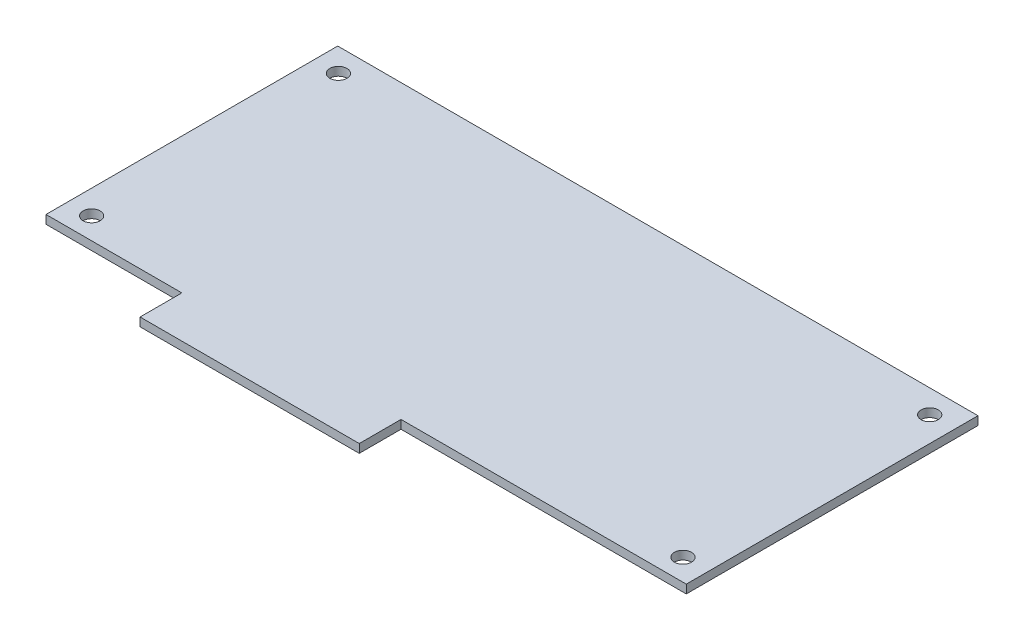
ISO-10303-21;
HEADER;
FILE_DESCRIPTION(('STEP AP214'),'2;1');
FILE_NAME('part.step','',(''),(''),'','','');
FILE_SCHEMA(('AUTOMOTIVE_DESIGN { 1 0 10303 214 1 1 1 1 }'));
ENDSEC;
DATA;
#1=APPLICATION_CONTEXT('core data for automotive mechanical design processes');
#2=APPLICATION_PROTOCOL_DEFINITION('international standard','automotive_design',2000,#1);
#3=PRODUCT_CONTEXT('',#1,'mechanical');
#4=PRODUCT('Part','Part','',(#3));
#5=PRODUCT_RELATED_PRODUCT_CATEGORY('part','',(#4));
#6=PRODUCT_DEFINITION_FORMATION('','',#4);
#7=PRODUCT_DEFINITION_CONTEXT('part definition',#1,'design');
#8=PRODUCT_DEFINITION('design','',#6,#7);
#9=PRODUCT_DEFINITION_SHAPE('','',#8);
#10=(LENGTH_UNIT() NAMED_UNIT(*) SI_UNIT(.MILLI.,.METRE.));
#11=(NAMED_UNIT(*) PLANE_ANGLE_UNIT() SI_UNIT($,.RADIAN.));
#12=(NAMED_UNIT(*) SI_UNIT($,.STERADIAN.) SOLID_ANGLE_UNIT());
#13=UNCERTAINTY_MEASURE_WITH_UNIT(LENGTH_MEASURE(1.E-05),#10,'distance_accuracy_value','');
#14=(GEOMETRIC_REPRESENTATION_CONTEXT(3) GLOBAL_UNCERTAINTY_ASSIGNED_CONTEXT((#13)) GLOBAL_UNIT_ASSIGNED_CONTEXT((#10,
#11,#12)) REPRESENTATION_CONTEXT('',''));
#15=CARTESIAN_POINT('',(0.,0.,0.));
#16=DIRECTION('',(0.,0.,1.));
#17=DIRECTION('',(1.,0.,0.));
#18=AXIS2_PLACEMENT_3D('',#15,#16,#17);
#19=CARTESIAN_POINT('',(6.64020617013405,1.6256,0.));
#20=DIRECTION('',(1.,0.,0.));
#21=DIRECTION('',(0.,0.,-1.));
#22=AXIS2_PLACEMENT_3D('',#19,#20,#21);
#23=PLANE('',#22);
#24=DIRECTION('',(0.,0.,1.));
#25=VECTOR('',#24,1.);
#26=CARTESIAN_POINT('',(6.64020617013405,0.,0.));
#27=LINE('',#26,#25);
#28=CARTESIAN_POINT('',(6.64020617013405,0.,23.7998));
#29=VERTEX_POINT('',#28);
#30=CARTESIAN_POINT('',(6.64020617013405,0.,31.75));
#31=VERTEX_POINT('',#30);
#32=EDGE_CURVE('E124',#29,#31,#27,.T.);
#33=ORIENTED_EDGE('',*,*,#32,.F.);
#34=DIRECTION('',(0.,-1.,0.));
#35=VECTOR('',#34,1.);
#36=CARTESIAN_POINT('',(6.64020617013405,1.6256,23.7998));
#37=LINE('',#36,#35);
#38=CARTESIAN_POINT('',(6.64020617013405,1.6256,23.7998));
#39=VERTEX_POINT('',#38);
#40=EDGE_CURVE('E11',#39,#29,#37,.T.);
#41=ORIENTED_EDGE('',*,*,#40,.F.);
#42=DIRECTION('',(0.,0.,1.));
#43=VECTOR('',#42,1.);
#44=CARTESIAN_POINT('',(6.64020617013405,1.6256,0.));
#45=LINE('',#44,#43);
#46=CARTESIAN_POINT('',(6.64020617013405,1.6256,31.75));
#47=VERTEX_POINT('',#46);
#48=EDGE_CURVE('E144',#39,#47,#45,.T.);
#49=ORIENTED_EDGE('',*,*,#48,.T.);
#50=DIRECTION('',(0.,-1.,0.));
#51=VECTOR('',#50,1.);
#52=CARTESIAN_POINT('',(6.64020617013405,1.6256,31.75));
#53=LINE('',#52,#51);
#54=EDGE_CURVE('E48',#47,#31,#53,.T.);
#55=ORIENTED_EDGE('',*,*,#54,.T.);
#56=EDGE_LOOP('',(#33,#41,#49,#55));
#57=FACE_BOUND('',#56,.T.);
#58=ADVANCED_FACE('F32',(#57),#23,.T.);
#59=CARTESIAN_POINT('',(0.,1.6256,23.7998));
#60=DIRECTION('',(0.,0.,1.));
#61=DIRECTION('',(1.,0.,0.));
#62=AXIS2_PLACEMENT_3D('',#59,#60,#61);
#63=PLANE('',#62);
#64=DIRECTION('',(-1.,0.,0.));
#65=VECTOR('',#64,1.);
#66=CARTESIAN_POINT('',(0.,0.,23.7998));
#67=LINE('',#66,#65);
#68=CARTESIAN_POINT('',(60.96,0.,23.7998));
#69=VERTEX_POINT('',#68);
#70=EDGE_CURVE('E126',#69,#29,#67,.T.);
#71=ORIENTED_EDGE('',*,*,#70,.F.);
#72=DIRECTION('',(0.,-1.,0.));
#73=VECTOR('',#72,1.);
#74=CARTESIAN_POINT('',(60.96,1.6256,23.7998));
#75=LINE('',#74,#73);
#76=CARTESIAN_POINT('',(60.96,1.6256,23.7998));
#77=VERTEX_POINT('',#76);
#78=EDGE_CURVE('E40',#77,#69,#75,.T.);
#79=ORIENTED_EDGE('',*,*,#78,.F.);
#80=DIRECTION('',(-1.,0.,0.));
#81=VECTOR('',#80,1.);
#82=CARTESIAN_POINT('',(0.,1.6256,23.7998));
#83=LINE('',#82,#81);
#84=EDGE_CURVE('E166',#77,#39,#83,.T.);
#85=ORIENTED_EDGE('',*,*,#84,.T.);
#86=ORIENTED_EDGE('',*,*,#40,.T.);
#87=EDGE_LOOP('',(#71,#79,#85,#86));
#88=FACE_BOUND('',#87,.T.);
#89=ADVANCED_FACE('F165',(#88),#63,.T.);
#90=CARTESIAN_POINT('',(60.96,1.6256,0.));
#91=DIRECTION('',(-1.,0.,0.));
#92=DIRECTION('',(0.,0.,1.));
#93=AXIS2_PLACEMENT_3D('',#90,#91,#92);
#94=PLANE('',#93);
#95=DIRECTION('',(0.,0.,-1.));
#96=VECTOR('',#95,1.);
#97=CARTESIAN_POINT('',(60.96,0.,0.));
#98=LINE('',#97,#96);
#99=CARTESIAN_POINT('',(60.96,0.,-31.75));
#100=VERTEX_POINT('',#99);
#101=EDGE_CURVE('E130',#69,#100,#98,.T.);
#102=ORIENTED_EDGE('',*,*,#101,.T.);
#103=DIRECTION('',(0.,-1.,0.));
#104=VECTOR('',#103,1.);
#105=CARTESIAN_POINT('',(60.96,1.6256,-31.75));
#106=LINE('',#105,#104);
#107=CARTESIAN_POINT('',(60.96,1.6256,-31.75));
#108=VERTEX_POINT('',#107);
#109=EDGE_CURVE('E150',#108,#100,#106,.T.);
#110=ORIENTED_EDGE('',*,*,#109,.F.);
#111=DIRECTION('',(0.,0.,-1.));
#112=VECTOR('',#111,1.);
#113=CARTESIAN_POINT('',(60.96,1.6256,0.));
#114=LINE('',#113,#112);
#115=EDGE_CURVE('E157',#77,#108,#114,.T.);
#116=ORIENTED_EDGE('',*,*,#115,.F.);
#117=ORIENTED_EDGE('',*,*,#78,.T.);
#118=EDGE_LOOP('',(#102,#110,#116,#117));
#119=FACE_BOUND('',#118,.T.);
#120=ADVANCED_FACE('F155',(#119),#94,.F.);
#121=CARTESIAN_POINT('',(0.,1.6256,-31.75));
#122=DIRECTION('',(0.,0.,1.));
#123=DIRECTION('',(1.,0.,0.));
#124=AXIS2_PLACEMENT_3D('',#121,#122,#123);
#125=PLANE('',#124);
#126=DIRECTION('',(-1.,0.,0.));
#127=VECTOR('',#126,1.);
#128=CARTESIAN_POINT('',(0.,0.,-31.75));
#129=LINE('',#128,#127);
#130=CARTESIAN_POINT('',(-60.96,0.,-31.75));
#131=VERTEX_POINT('',#130);
#132=EDGE_CURVE('E132',#100,#131,#129,.T.);
#133=ORIENTED_EDGE('',*,*,#132,.T.);
#134=DIRECTION('',(0.,-1.,0.));
#135=VECTOR('',#134,1.);
#136=CARTESIAN_POINT('',(-60.96,1.6256,-31.75));
#137=LINE('',#136,#135);
#138=CARTESIAN_POINT('',(-60.96,1.6256,-31.75));
#139=VERTEX_POINT('',#138);
#140=EDGE_CURVE('E148',#139,#131,#137,.T.);
#141=ORIENTED_EDGE('',*,*,#140,.F.);
#142=DIRECTION('',(-1.,0.,0.));
#143=VECTOR('',#142,1.);
#144=CARTESIAN_POINT('',(0.,1.6256,-31.75));
#145=LINE('',#144,#143);
#146=EDGE_CURVE('E296',#108,#139,#145,.T.);
#147=ORIENTED_EDGE('',*,*,#146,.F.);
#148=ORIENTED_EDGE('',*,*,#109,.T.);
#149=EDGE_LOOP('',(#133,#141,#147,#148));
#150=FACE_BOUND('',#149,.T.);
#151=ADVANCED_FACE('F185',(#150),#125,.F.);
#152=CARTESIAN_POINT('',(-60.96,1.6256,0.));
#153=DIRECTION('',(-1.,0.,0.));
#154=DIRECTION('',(0.,0.,1.));
#155=AXIS2_PLACEMENT_3D('',#152,#153,#154);
#156=PLANE('',#155);
#157=DIRECTION('',(0.,0.,-1.));
#158=VECTOR('',#157,1.);
#159=CARTESIAN_POINT('',(-60.96,0.,0.));
#160=LINE('',#159,#158);
#161=CARTESIAN_POINT('',(-60.96,0.,23.7998));
#162=VERTEX_POINT('',#161);
#163=EDGE_CURVE('E135',#162,#131,#160,.T.);
#164=ORIENTED_EDGE('',*,*,#163,.F.);
#165=DIRECTION('',(0.,-1.,0.));
#166=VECTOR('',#165,1.);
#167=CARTESIAN_POINT('',(-60.96,1.6256,23.7998));
#168=LINE('',#167,#166);
#169=CARTESIAN_POINT('',(-60.96,1.6256,23.7998));
#170=VERTEX_POINT('',#169);
#171=EDGE_CURVE('E116',#170,#162,#168,.T.);
#172=ORIENTED_EDGE('',*,*,#171,.F.);
#173=DIRECTION('',(0.,0.,-1.));
#174=VECTOR('',#173,1.);
#175=CARTESIAN_POINT('',(-60.96,1.6256,0.));
#176=LINE('',#175,#174);
#177=EDGE_CURVE('E106',#170,#139,#176,.T.);
#178=ORIENTED_EDGE('',*,*,#177,.T.);
#179=ORIENTED_EDGE('',*,*,#140,.T.);
#180=EDGE_LOOP('',(#164,#172,#178,#179));
#181=FACE_BOUND('',#180,.T.);
#182=ADVANCED_FACE('F190',(#181),#156,.T.);
#183=CARTESIAN_POINT('',(0.,1.6256,23.7998));
#184=DIRECTION('',(0.,0.,-1.));
#185=DIRECTION('',(-1.,0.,0.));
#186=AXIS2_PLACEMENT_3D('',#183,#184,#185);
#187=PLANE('',#186);
#188=DIRECTION('',(1.,0.,0.));
#189=VECTOR('',#188,1.);
#190=CARTESIAN_POINT('',(0.,0.,23.7998));
#191=LINE('',#190,#189);
#192=CARTESIAN_POINT('',(-35.0919938298659,0.,23.7998));
#193=VERTEX_POINT('',#192);
#194=EDGE_CURVE('E113',#162,#193,#191,.T.);
#195=ORIENTED_EDGE('',*,*,#194,.T.);
#196=DIRECTION('',(0.,-1.,0.));
#197=VECTOR('',#196,1.);
#198=CARTESIAN_POINT('',(-35.0919938298659,1.6256,23.7998));
#199=LINE('',#198,#197);
#200=CARTESIAN_POINT('',(-35.0919938298659,1.6256,23.7998));
#201=VERTEX_POINT('',#200);
#202=EDGE_CURVE('E110',#201,#193,#199,.T.);
#203=ORIENTED_EDGE('',*,*,#202,.F.);
#204=DIRECTION('',(1.,0.,0.));
#205=VECTOR('',#204,1.);
#206=CARTESIAN_POINT('',(0.,1.6256,23.7998));
#207=LINE('',#206,#205);
#208=EDGE_CURVE('E99',#170,#201,#207,.T.);
#209=ORIENTED_EDGE('',*,*,#208,.F.);
#210=ORIENTED_EDGE('',*,*,#171,.T.);
#211=EDGE_LOOP('',(#195,#203,#209,#210));
#212=FACE_BOUND('',#211,.T.);
#213=ADVANCED_FACE('F111',(#212),#187,.F.);
#214=CARTESIAN_POINT('',(-35.091993829866,1.6256,0.));
#215=DIRECTION('',(1.,0.,0.));
#216=DIRECTION('',(0.,0.,-1.));
#217=AXIS2_PLACEMENT_3D('',#214,#215,#216);
#218=PLANE('',#217);
#219=DIRECTION('',(0.,0.,1.));
#220=VECTOR('',#219,1.);
#221=CARTESIAN_POINT('',(-35.091993829866,0.,0.));
#222=LINE('',#221,#220);
#223=CARTESIAN_POINT('',(-35.0919938298659,0.,31.75));
#224=VERTEX_POINT('',#223);
#225=EDGE_CURVE('E139',#193,#224,#222,.T.);
#226=ORIENTED_EDGE('',*,*,#225,.T.);
#227=DIRECTION('',(0.,-1.,0.));
#228=VECTOR('',#227,1.);
#229=CARTESIAN_POINT('',(-35.0919938298659,1.6256,31.75));
#230=LINE('',#229,#228);
#231=CARTESIAN_POINT('',(-35.0919938298659,1.6256,31.75));
#232=VERTEX_POINT('',#231);
#233=EDGE_CURVE('E74',#232,#224,#230,.T.);
#234=ORIENTED_EDGE('',*,*,#233,.F.);
#235=DIRECTION('',(0.,0.,1.));
#236=VECTOR('',#235,1.);
#237=CARTESIAN_POINT('',(-35.091993829866,1.6256,0.));
#238=LINE('',#237,#236);
#239=EDGE_CURVE('E104',#201,#232,#238,.T.);
#240=ORIENTED_EDGE('',*,*,#239,.F.);
#241=ORIENTED_EDGE('',*,*,#202,.T.);
#242=EDGE_LOOP('',(#226,#234,#240,#241));
#243=FACE_BOUND('',#242,.T.);
#244=ADVANCED_FACE('F118',(#243),#218,.F.);
#245=CARTESIAN_POINT('',(0.,1.6256,31.75));
#246=DIRECTION('',(0.,0.,1.));
#247=DIRECTION('',(1.,0.,0.));
#248=AXIS2_PLACEMENT_3D('',#245,#246,#247);
#249=PLANE('',#248);
#250=DIRECTION('',(-1.,0.,0.));
#251=VECTOR('',#250,1.);
#252=CARTESIAN_POINT('',(0.,0.,31.75));
#253=LINE('',#252,#251);
#254=EDGE_CURVE('E141',#31,#224,#253,.T.);
#255=ORIENTED_EDGE('',*,*,#254,.F.);
#256=ORIENTED_EDGE('',*,*,#54,.F.);
#257=DIRECTION('',(-1.,0.,0.));
#258=VECTOR('',#257,1.);
#259=CARTESIAN_POINT('',(0.,1.6256,31.75));
#260=LINE('',#259,#258);
#261=EDGE_CURVE('E119',#47,#232,#260,.T.);
#262=ORIENTED_EDGE('',*,*,#261,.T.);
#263=ORIENTED_EDGE('',*,*,#233,.T.);
#264=EDGE_LOOP('',(#255,#256,#262,#263));
#265=FACE_BOUND('',#264,.T.);
#266=ADVANCED_FACE('F167',(#265),#249,.T.);
#267=CARTESIAN_POINT('',(0.,1.6256,0.));
#268=DIRECTION('',(0.,1.,0.));
#269=DIRECTION('',(0.,0.,1.));
#270=AXIS2_PLACEMENT_3D('',#267,#268,#269);
#271=PLANE('',#270);
#272=CARTESIAN_POINT('',(56.2102,1.6256,19.685));
#273=DIRECTION('',(0.,1.,0.));
#274=DIRECTION('',(0.,0.,1.));
#275=AXIS2_PLACEMENT_3D('',#272,#273,#274);
#276=CIRCLE('',#275,1.63194999999999);
#277=CARTESIAN_POINT('',(56.2102,1.6256,21.31695));
#278=VERTEX_POINT('',#277);
#279=EDGE_CURVE('E269',#278,#278,#276,.T.);
#280=ORIENTED_EDGE('',*,*,#279,.F.);
#281=EDGE_LOOP('',(#280));
#282=FACE_BOUND('',#281,.T.);
#283=CARTESIAN_POINT('',(56.2102,1.6256,-27.305));
#284=DIRECTION('',(0.,1.,0.));
#285=DIRECTION('',(0.,0.,1.));
#286=AXIS2_PLACEMENT_3D('',#283,#284,#285);
#287=CIRCLE('',#286,1.63194999999999);
#288=CARTESIAN_POINT('',(56.2102,1.6256,-25.67305));
#289=VERTEX_POINT('',#288);
#290=EDGE_CURVE('E279',#289,#289,#287,.T.);
#291=ORIENTED_EDGE('',*,*,#290,.F.);
#292=EDGE_LOOP('',(#291));
#293=FACE_BOUND('',#292,.T.);
#294=CARTESIAN_POINT('',(-56.388,1.6256,-27.305));
#295=DIRECTION('',(0.,1.,0.));
#296=DIRECTION('',(0.,0.,1.));
#297=AXIS2_PLACEMENT_3D('',#294,#295,#296);
#298=CIRCLE('',#297,1.63194999999999);
#299=CARTESIAN_POINT('',(-56.388,1.6256,-25.67305));
#300=VERTEX_POINT('',#299);
#301=EDGE_CURVE('E285',#300,#300,#298,.T.);
#302=ORIENTED_EDGE('',*,*,#301,.F.);
#303=EDGE_LOOP('',(#302));
#304=FACE_BOUND('',#303,.T.);
#305=CARTESIAN_POINT('',(-56.388,1.6256,19.685));
#306=DIRECTION('',(0.,1.,0.));
#307=DIRECTION('',(0.,0.,1.));
#308=AXIS2_PLACEMENT_3D('',#305,#306,#307);
#309=CIRCLE('',#308,1.63194999999999);
#310=CARTESIAN_POINT('',(-56.388,1.6256,21.31695));
#311=VERTEX_POINT('',#310);
#312=EDGE_CURVE('E127',#311,#311,#309,.T.);
#313=ORIENTED_EDGE('',*,*,#312,.F.);
#314=EDGE_LOOP('',(#313));
#315=FACE_BOUND('',#314,.T.);
#316=ORIENTED_EDGE('',*,*,#48,.F.);
#317=ORIENTED_EDGE('',*,*,#84,.F.);
#318=ORIENTED_EDGE('',*,*,#115,.T.);
#319=ORIENTED_EDGE('',*,*,#146,.T.);
#320=ORIENTED_EDGE('',*,*,#177,.F.);
#321=ORIENTED_EDGE('',*,*,#208,.T.);
#322=ORIENTED_EDGE('',*,*,#239,.T.);
#323=ORIENTED_EDGE('',*,*,#261,.F.);
#324=EDGE_LOOP('',(#316,#317,#318,#319,#320,#321,#322,#323));
#325=FACE_BOUND('',#324,.T.);
#326=ADVANCED_FACE('F101',(#282,#293,#304,#315,#325),#271,.T.);
#327=CARTESIAN_POINT('',(0.,0.,0.));
#328=DIRECTION('',(0.,1.,0.));
#329=DIRECTION('',(0.,0.,1.));
#330=AXIS2_PLACEMENT_3D('',#327,#328,#329);
#331=PLANE('',#330);
#332=CARTESIAN_POINT('',(56.2102,0.,19.685));
#333=DIRECTION('',(0.,-1.,0.));
#334=DIRECTION('',(0.,0.,-1.));
#335=AXIS2_PLACEMENT_3D('',#332,#333,#334);
#336=CIRCLE('',#335,1.63194999999999);
#337=CARTESIAN_POINT('',(56.2102,0.,18.05305));
#338=VERTEX_POINT('',#337);
#339=EDGE_CURVE('E272',#338,#338,#336,.T.);
#340=ORIENTED_EDGE('',*,*,#339,.F.);
#341=EDGE_LOOP('',(#340));
#342=FACE_BOUND('',#341,.T.);
#343=CARTESIAN_POINT('',(56.2102,0.,-27.305));
#344=DIRECTION('',(0.,-1.,0.));
#345=DIRECTION('',(0.,0.,-1.));
#346=AXIS2_PLACEMENT_3D('',#343,#344,#345);
#347=CIRCLE('',#346,1.63194999999999);
#348=CARTESIAN_POINT('',(56.2102,0.,-28.93695));
#349=VERTEX_POINT('',#348);
#350=EDGE_CURVE('E274',#349,#349,#347,.T.);
#351=ORIENTED_EDGE('',*,*,#350,.F.);
#352=EDGE_LOOP('',(#351));
#353=FACE_BOUND('',#352,.T.);
#354=CARTESIAN_POINT('',(-56.388,0.,-27.305));
#355=DIRECTION('',(0.,-1.,0.));
#356=DIRECTION('',(0.,0.,-1.));
#357=AXIS2_PLACEMENT_3D('',#354,#355,#356);
#358=CIRCLE('',#357,1.63194999999999);
#359=CARTESIAN_POINT('',(-56.388,0.,-28.93695));
#360=VERTEX_POINT('',#359);
#361=EDGE_CURVE('E282',#360,#360,#358,.T.);
#362=ORIENTED_EDGE('',*,*,#361,.F.);
#363=EDGE_LOOP('',(#362));
#364=FACE_BOUND('',#363,.T.);
#365=CARTESIAN_POINT('',(-56.388,0.,19.685));
#366=DIRECTION('',(0.,-1.,0.));
#367=DIRECTION('',(0.,0.,-1.));
#368=AXIS2_PLACEMENT_3D('',#365,#366,#367);
#369=CIRCLE('',#368,1.63194999999999);
#370=CARTESIAN_POINT('',(-56.388,0.,18.05305));
#371=VERTEX_POINT('',#370);
#372=EDGE_CURVE('E288',#371,#371,#369,.T.);
#373=ORIENTED_EDGE('',*,*,#372,.F.);
#374=EDGE_LOOP('',(#373));
#375=FACE_BOUND('',#374,.T.);
#376=ORIENTED_EDGE('',*,*,#32,.T.);
#377=ORIENTED_EDGE('',*,*,#254,.T.);
#378=ORIENTED_EDGE('',*,*,#225,.F.);
#379=ORIENTED_EDGE('',*,*,#194,.F.);
#380=ORIENTED_EDGE('',*,*,#163,.T.);
#381=ORIENTED_EDGE('',*,*,#132,.F.);
#382=ORIENTED_EDGE('',*,*,#101,.F.);
#383=ORIENTED_EDGE('',*,*,#70,.T.);
#384=EDGE_LOOP('',(#376,#377,#378,#379,#380,#381,#382,#383));
#385=FACE_BOUND('',#384,.T.);
#386=ADVANCED_FACE('F164',(#342,#353,#364,#375,#385),#331,.F.);
#387=CARTESIAN_POINT('',(-56.388,0.,19.685));
#388=DIRECTION('',(0.,-1.,0.));
#389=DIRECTION('',(0.,0.,-1.));
#390=AXIS2_PLACEMENT_3D('',#387,#388,#389);
#391=CYLINDRICAL_SURFACE('',#390,1.63194999999999);
#392=ORIENTED_EDGE('',*,*,#312,.T.);
#393=EDGE_LOOP('',(#392));
#394=FACE_BOUND('',#393,.T.);
#395=ORIENTED_EDGE('',*,*,#372,.T.);
#396=EDGE_LOOP('',(#395));
#397=FACE_BOUND('',#396,.T.);
#398=ADVANCED_FACE('F223',(#394,#397),#391,.F.);
#399=CARTESIAN_POINT('',(-56.388,0.,-27.305));
#400=DIRECTION('',(0.,-1.,0.));
#401=DIRECTION('',(0.,0.,-1.));
#402=AXIS2_PLACEMENT_3D('',#399,#400,#401);
#403=CYLINDRICAL_SURFACE('',#402,1.63194999999999);
#404=ORIENTED_EDGE('',*,*,#301,.T.);
#405=EDGE_LOOP('',(#404));
#406=FACE_BOUND('',#405,.T.);
#407=ORIENTED_EDGE('',*,*,#361,.T.);
#408=EDGE_LOOP('',(#407));
#409=FACE_BOUND('',#408,.T.);
#410=ADVANCED_FACE('F232',(#406,#409),#403,.F.);
#411=CARTESIAN_POINT('',(56.2102,0.,-27.305));
#412=DIRECTION('',(0.,-1.,0.));
#413=DIRECTION('',(0.,0.,-1.));
#414=AXIS2_PLACEMENT_3D('',#411,#412,#413);
#415=CYLINDRICAL_SURFACE('',#414,1.63194999999999);
#416=ORIENTED_EDGE('',*,*,#290,.T.);
#417=EDGE_LOOP('',(#416));
#418=FACE_BOUND('',#417,.T.);
#419=ORIENTED_EDGE('',*,*,#350,.T.);
#420=EDGE_LOOP('',(#419));
#421=FACE_BOUND('',#420,.T.);
#422=ADVANCED_FACE('F242',(#418,#421),#415,.F.);
#423=CARTESIAN_POINT('',(56.2102,0.,19.685));
#424=DIRECTION('',(0.,-1.,0.));
#425=DIRECTION('',(0.,0.,-1.));
#426=AXIS2_PLACEMENT_3D('',#423,#424,#425);
#427=CYLINDRICAL_SURFACE('',#426,1.63194999999999);
#428=ORIENTED_EDGE('',*,*,#279,.T.);
#429=EDGE_LOOP('',(#428));
#430=FACE_BOUND('',#429,.T.);
#431=ORIENTED_EDGE('',*,*,#339,.T.);
#432=EDGE_LOOP('',(#431));
#433=FACE_BOUND('',#432,.T.);
#434=ADVANCED_FACE('F252',(#430,#433),#427,.F.);
#435=CLOSED_SHELL('',(#58,#89,#120,#151,#182,#213,#244,#266,#326,#386,#398,#410,#422,#434));
#436=MANIFOLD_SOLID_BREP('B2',#435);
#437=ADVANCED_BREP_SHAPE_REPRESENTATION('',(#18,#436),#14);
#438=SHAPE_DEFINITION_REPRESENTATION(#9,#437);
ENDSEC;
END-ISO-10303-21;
